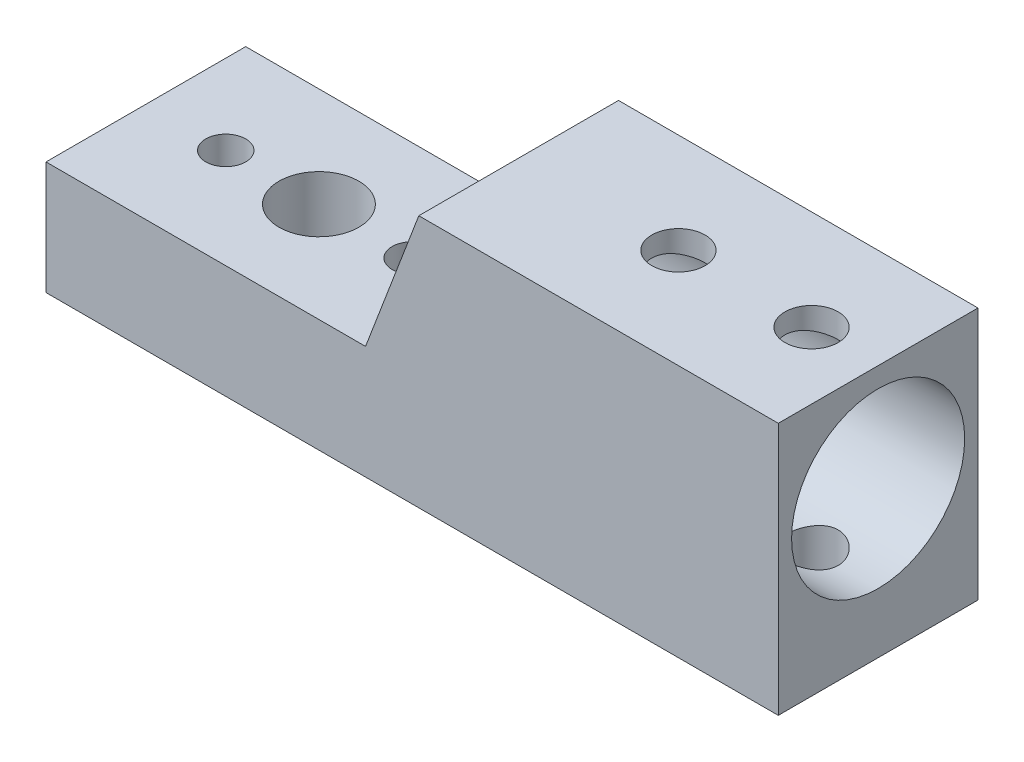
ISO-10303-21;
HEADER;
FILE_DESCRIPTION(('STEP AP214'),'2;1');
FILE_NAME('part.step','',(''),(''),'','','');
FILE_SCHEMA(('AUTOMOTIVE_DESIGN { 1 0 10303 214 1 1 1 1 }'));
ENDSEC;
DATA;
#1=APPLICATION_CONTEXT('core data for automotive mechanical design processes');
#2=APPLICATION_PROTOCOL_DEFINITION('international standard','automotive_design',2000,#1);
#3=PRODUCT_CONTEXT('',#1,'mechanical');
#4=PRODUCT('Part','Part','',(#3));
#5=PRODUCT_RELATED_PRODUCT_CATEGORY('part','',(#4));
#6=PRODUCT_DEFINITION_FORMATION('','',#4);
#7=PRODUCT_DEFINITION_CONTEXT('part definition',#1,'design');
#8=PRODUCT_DEFINITION('design','',#6,#7);
#9=PRODUCT_DEFINITION_SHAPE('','',#8);
#10=(LENGTH_UNIT() NAMED_UNIT(*) SI_UNIT(.MILLI.,.METRE.));
#11=(NAMED_UNIT(*) PLANE_ANGLE_UNIT() SI_UNIT($,.RADIAN.));
#12=(NAMED_UNIT(*) SI_UNIT($,.STERADIAN.) SOLID_ANGLE_UNIT());
#13=UNCERTAINTY_MEASURE_WITH_UNIT(LENGTH_MEASURE(1.E-05),#10,'distance_accuracy_value','');
#14=(GEOMETRIC_REPRESENTATION_CONTEXT(3) GLOBAL_UNCERTAINTY_ASSIGNED_CONTEXT((#13)) GLOBAL_UNIT_ASSIGNED_CONTEXT((#10,
#11,#12)) REPRESENTATION_CONTEXT('',''));
#15=CARTESIAN_POINT('',(0.,0.,0.));
#16=DIRECTION('',(0.,0.,1.));
#17=DIRECTION('',(1.,0.,0.));
#18=AXIS2_PLACEMENT_3D('',#15,#16,#17);
#19=CARTESIAN_POINT('',(-9.99999999999999,-11.,1.44582529709298E-13));
#20=DIRECTION('',(0.,1.,0.));
#21=DIRECTION('',(0.,0.,1.));
#22=AXIS2_PLACEMENT_3D('',#19,#20,#21);
#23=CYLINDRICAL_SURFACE('',#22,1.5);
#24=CARTESIAN_POINT('',(-9.99999999999999,-2.5,1.45716771982052E-13));
#25=DIRECTION('',(0.,1.,0.));
#26=DIRECTION('',(0.,0.,1.));
#27=AXIS2_PLACEMENT_3D('',#24,#25,#26);
#28=CIRCLE('',#27,1.5);
#29=CARTESIAN_POINT('',(-9.99999999999999,-2.5,1.50000000000015));
#30=VERTEX_POINT('',#29);
#31=EDGE_CURVE('E214',#30,#30,#28,.T.);
#32=ORIENTED_EDGE('',*,*,#31,.T.);
#33=EDGE_LOOP('',(#32));
#34=FACE_BOUND('',#33,.T.);
#35=CARTESIAN_POINT('',(-9.99999999999999,-8.,1.44982850511446E-13));
#36=DIRECTION('',(0.,-1.,0.));
#37=DIRECTION('',(0.,0.,-1.));
#38=AXIS2_PLACEMENT_3D('',#35,#36,#37);
#39=CIRCLE('',#38,1.5);
#40=CARTESIAN_POINT('',(-9.99999999999999,-8.,-1.49999999999986));
#41=VERTEX_POINT('',#40);
#42=EDGE_CURVE('E41',#41,#41,#39,.F.);
#43=ORIENTED_EDGE('',*,*,#42,.F.);
#44=EDGE_LOOP('',(#43));
#45=FACE_BOUND('',#44,.T.);
#46=ADVANCED_FACE('F37',(#34,#45),#23,.F.);
#47=CARTESIAN_POINT('',(25.,0.,7.5));
#48=DIRECTION('',(0.,0.,1.));
#49=DIRECTION('',(1.,0.,0.));
#50=AXIS2_PLACEMENT_3D('',#47,#48,#49);
#51=PLANE('',#50);
#52=DIRECTION('',(-1.,0.,0.));
#53=VECTOR('',#52,1.);
#54=CARTESIAN_POINT('',(25.,8.,7.5));
#55=LINE('',#54,#53);
#56=CARTESIAN_POINT('',(25.,8.,7.5));
#57=VERTEX_POINT('',#56);
#58=CARTESIAN_POINT('',(-2.,8.,7.5));
#59=VERTEX_POINT('',#58);
#60=EDGE_CURVE('E189',#57,#59,#55,.T.);
#61=ORIENTED_EDGE('',*,*,#60,.T.);
#62=DIRECTION('',(0.35599532759199,0.934487734928967,0.));
#63=VECTOR('',#62,1.);
#64=CARTESIAN_POINT('',(-6.,-2.5,7.5));
#65=LINE('',#64,#63);
#66=CARTESIAN_POINT('',(-6.00000000000001,-2.5,7.5));
#67=VERTEX_POINT('',#66);
#68=EDGE_CURVE('E11',#59,#67,#65,.F.);
#69=ORIENTED_EDGE('',*,*,#68,.T.);
#70=DIRECTION('',(1.,0.,0.));
#71=VECTOR('',#70,1.);
#72=CARTESIAN_POINT('',(-30.,-2.5,7.5));
#73=LINE('',#72,#71);
#74=CARTESIAN_POINT('',(-30.,-2.5,7.5));
#75=VERTEX_POINT('',#74);
#76=EDGE_CURVE('E124',#75,#67,#73,.T.);
#77=ORIENTED_EDGE('',*,*,#76,.F.);
#78=DIRECTION('',(0.,1.,0.));
#79=VECTOR('',#78,1.);
#80=CARTESIAN_POINT('',(-30.,-11.,7.5));
#81=LINE('',#80,#79);
#82=CARTESIAN_POINT('',(-30.,-11.,7.5));
#83=VERTEX_POINT('',#82);
#84=EDGE_CURVE('E112',#83,#75,#81,.T.);
#85=ORIENTED_EDGE('',*,*,#84,.F.);
#86=DIRECTION('',(-1.,0.,0.));
#87=VECTOR('',#86,1.);
#88=CARTESIAN_POINT('',(25.,-11.,7.5));
#89=LINE('',#88,#87);
#90=CARTESIAN_POINT('',(25.,-11.,7.5));
#91=VERTEX_POINT('',#90);
#92=EDGE_CURVE('E103',#91,#83,#89,.T.);
#93=ORIENTED_EDGE('',*,*,#92,.F.);
#94=DIRECTION('',(0.,1.,0.));
#95=VECTOR('',#94,1.);
#96=CARTESIAN_POINT('',(25.,0.,7.5));
#97=LINE('',#96,#95);
#98=EDGE_CURVE('E192',#91,#57,#97,.T.);
#99=ORIENTED_EDGE('',*,*,#98,.T.);
#100=EDGE_LOOP('',(#61,#69,#77,#85,#93,#99));
#101=FACE_BOUND('',#100,.T.);
#102=ADVANCED_FACE('F180',(#101),#51,.T.);
#103=CARTESIAN_POINT('',(25.,-11.,0.));
#104=DIRECTION('',(0.,1.,0.));
#105=DIRECTION('',(0.,0.,1.));
#106=AXIS2_PLACEMENT_3D('',#103,#104,#105);
#107=PLANE('',#106);
#108=CARTESIAN_POINT('',(-9.99999999999999,-11.,1.41704667942741E-13));
#109=DIRECTION('',(0.,-1.,0.));
#110=DIRECTION('',(0.,0.,-1.));
#111=AXIS2_PLACEMENT_3D('',#108,#109,#110);
#112=CIRCLE('',#111,3.);
#113=CARTESIAN_POINT('',(-9.99999999999999,-11.,-2.99999999999986));
#114=VERTEX_POINT('',#113);
#115=EDGE_CURVE('E216',#114,#114,#112,.T.);
#116=ORIENTED_EDGE('',*,*,#115,.F.);
#117=EDGE_LOOP('',(#116));
#118=FACE_BOUND('',#117,.T.);
#119=CARTESIAN_POINT('',(-24.,-11.,1.41704667942741E-13));
#120=DIRECTION('',(0.,-1.,0.));
#121=DIRECTION('',(0.,0.,1.));
#122=AXIS2_PLACEMENT_3D('',#119,#120,#121);
#123=CIRCLE('',#122,3.);
#124=CARTESIAN_POINT('',(-24.,-11.,3.00000000000014));
#125=VERTEX_POINT('',#124);
#126=EDGE_CURVE('E226',#125,#125,#123,.T.);
#127=ORIENTED_EDGE('',*,*,#126,.F.);
#128=EDGE_LOOP('',(#127));
#129=FACE_BOUND('',#128,.T.);
#130=CARTESIAN_POINT('',(10.,-11.,0.));
#131=DIRECTION('',(0.,1.,0.));
#132=DIRECTION('',(0.,0.,1.));
#133=AXIS2_PLACEMENT_3D('',#130,#131,#132);
#134=CIRCLE('',#133,2.);
#135=CARTESIAN_POINT('',(10.,-11.,2.));
#136=VERTEX_POINT('',#135);
#137=EDGE_CURVE('E133',#136,#136,#134,.T.);
#138=ORIENTED_EDGE('',*,*,#137,.T.);
#139=EDGE_LOOP('',(#138));
#140=FACE_BOUND('',#139,.T.);
#141=CARTESIAN_POINT('',(20.,-11.,0.));
#142=DIRECTION('',(0.,1.,0.));
#143=DIRECTION('',(0.,0.,1.));
#144=AXIS2_PLACEMENT_3D('',#141,#142,#143);
#145=CIRCLE('',#144,2.);
#146=CARTESIAN_POINT('',(20.,-11.,2.));
#147=VERTEX_POINT('',#146);
#148=EDGE_CURVE('E134',#147,#147,#145,.T.);
#149=ORIENTED_EDGE('',*,*,#148,.T.);
#150=EDGE_LOOP('',(#149));
#151=FACE_BOUND('',#150,.T.);
#152=ORIENTED_EDGE('',*,*,#92,.T.);
#153=DIRECTION('',(0.,0.,1.));
#154=VECTOR('',#153,1.);
#155=CARTESIAN_POINT('',(-30.,-11.,7.5));
#156=LINE('',#155,#154);
#157=CARTESIAN_POINT('',(-30.,-11.,-7.5));
#158=VERTEX_POINT('',#157);
#159=EDGE_CURVE('E109',#158,#83,#156,.T.);
#160=ORIENTED_EDGE('',*,*,#159,.F.);
#161=DIRECTION('',(-1.,0.,0.));
#162=VECTOR('',#161,1.);
#163=CARTESIAN_POINT('',(25.,-11.,-7.5));
#164=LINE('',#163,#162);
#165=CARTESIAN_POINT('',(25.,-11.,-7.5));
#166=VERTEX_POINT('',#165);
#167=EDGE_CURVE('E91',#166,#158,#164,.T.);
#168=ORIENTED_EDGE('',*,*,#167,.F.);
#169=DIRECTION('',(0.,0.,-1.));
#170=VECTOR('',#169,1.);
#171=CARTESIAN_POINT('',(25.,-11.,0.));
#172=LINE('',#171,#170);
#173=EDGE_CURVE('E244',#91,#166,#172,.T.);
#174=ORIENTED_EDGE('',*,*,#173,.F.);
#175=EDGE_LOOP('',(#152,#160,#168,#174));
#176=FACE_BOUND('',#175,.T.);
#177=CARTESIAN_POINT('',(-17.,-11.,0.));
#178=DIRECTION('',(0.,1.,0.));
#179=DIRECTION('',(0.,0.,1.));
#180=AXIS2_PLACEMENT_3D('',#177,#178,#179);
#181=CIRCLE('',#180,3.);
#182=CARTESIAN_POINT('',(-17.,-11.,3.));
#183=VERTEX_POINT('',#182);
#184=EDGE_CURVE('E126',#183,#183,#181,.T.);
#185=ORIENTED_EDGE('',*,*,#184,.T.);
#186=EDGE_LOOP('',(#185));
#187=FACE_BOUND('',#186,.T.);
#188=ADVANCED_FACE('F114',(#118,#129,#140,#151,#176,#187),#107,.F.);
#189=CARTESIAN_POINT('',(25.,0.,-7.5));
#190=DIRECTION('',(0.,0.,1.));
#191=DIRECTION('',(1.,0.,0.));
#192=AXIS2_PLACEMENT_3D('',#189,#190,#191);
#193=PLANE('',#192);
#194=ORIENTED_EDGE('',*,*,#167,.T.);
#195=DIRECTION('',(0.,1.,0.));
#196=VECTOR('',#195,1.);
#197=CARTESIAN_POINT('',(-30.,-11.,-7.5));
#198=LINE('',#197,#196);
#199=CARTESIAN_POINT('',(-30.,-2.5,-7.5));
#200=VERTEX_POINT('',#199);
#201=EDGE_CURVE('E95',#158,#200,#198,.T.);
#202=ORIENTED_EDGE('',*,*,#201,.T.);
#203=DIRECTION('',(-1.,0.,0.));
#204=VECTOR('',#203,1.);
#205=CARTESIAN_POINT('',(-30.,-2.5,-7.5));
#206=LINE('',#205,#204);
#207=CARTESIAN_POINT('',(-6.00000000000001,-2.5,-7.5));
#208=VERTEX_POINT('',#207);
#209=EDGE_CURVE('E118',#208,#200,#206,.T.);
#210=ORIENTED_EDGE('',*,*,#209,.F.);
#211=DIRECTION('',(-0.35599532759199,-0.934487734928967,0.));
#212=VECTOR('',#211,1.);
#213=CARTESIAN_POINT('',(-1.23960396039598,9.99603960396045,-7.5));
#214=LINE('',#213,#212);
#215=CARTESIAN_POINT('',(-2.,8.,-7.5));
#216=VERTEX_POINT('',#215);
#217=EDGE_CURVE('E46',#208,#216,#214,.F.);
#218=ORIENTED_EDGE('',*,*,#217,.T.);
#219=DIRECTION('',(-1.,0.,0.));
#220=VECTOR('',#219,1.);
#221=CARTESIAN_POINT('',(25.,8.,-7.5));
#222=LINE('',#221,#220);
#223=CARTESIAN_POINT('',(25.,8.,-7.5));
#224=VERTEX_POINT('',#223);
#225=EDGE_CURVE('E104',#224,#216,#222,.T.);
#226=ORIENTED_EDGE('',*,*,#225,.F.);
#227=DIRECTION('',(0.,1.,0.));
#228=VECTOR('',#227,1.);
#229=CARTESIAN_POINT('',(25.,0.,-7.5));
#230=LINE('',#229,#228);
#231=EDGE_CURVE('E98',#166,#224,#230,.T.);
#232=ORIENTED_EDGE('',*,*,#231,.F.);
#233=EDGE_LOOP('',(#194,#202,#210,#218,#226,#232));
#234=FACE_BOUND('',#233,.T.);
#235=ADVANCED_FACE('F93',(#234),#193,.F.);
#236=CARTESIAN_POINT('',(25.,0.,0.));
#237=DIRECTION('',(-1.,0.,0.));
#238=DIRECTION('',(0.,0.,1.));
#239=AXIS2_PLACEMENT_3D('',#236,#237,#238);
#240=CYLINDRICAL_SURFACE('',#239,6.5);
#241=CARTESIAN_POINT('',(10.,-6.18465843842649,2.));
#242=CARTESIAN_POINT('',(10.1094478166652,-6.18465930196192,1.9999990095568));
#243=CARTESIAN_POINT('',(10.2189054848382,-6.18759551962699,1.99098535833565));
#244=CARTESIAN_POINT('',(10.4346111816852,-6.19897317486936,1.95526805100871));
#245=CARTESIAN_POINT('',(10.5408582544629,-6.20741623543611,1.92855917969017));
#246=CARTESIAN_POINT('',(10.746987807974,-6.22876273970596,1.85845185053104));
#247=CARTESIAN_POINT('',(10.8468809407582,-6.24165847214778,1.8150822317129));
#248=CARTESIAN_POINT('',(11.0379998508988,-6.27044669026987,1.71298018316394));
#249=CARTESIAN_POINT('',(11.1292241832341,-6.28633967425533,1.65424519824938));
#250=CARTESIAN_POINT('',(11.303453569472,-6.31992519486664,1.52098542811857));
#251=CARTESIAN_POINT('',(11.3861274234922,-6.33765756932836,1.44603755808562));
#252=CARTESIAN_POINT('',(11.5379537180837,-6.37258438430366,1.28338536224739));
#253=CARTESIAN_POINT('',(11.607104329982,-6.38977875180184,1.19567931401686));
#254=CARTESIAN_POINT('',(11.7313736379995,-6.4221466710909,1.00762969104172));
#255=CARTESIAN_POINT('',(11.7861525678529,-6.43726783390859,0.907051779246697));
#256=CARTESIAN_POINT('',(11.8778889420094,-6.46332130744831,0.697566498611637));
#257=CARTESIAN_POINT('',(11.9148504403184,-6.47425457092804,0.588661031083086));
#258=CARTESIAN_POINT('',(11.9688007146125,-6.49041842306583,0.369078789668962));
#259=CARTESIAN_POINT('',(11.986355276722,-6.49581021502431,0.258553108996815));
#260=CARTESIAN_POINT('',(12.0027846064267,-6.50085231846729,0.0360024805210005));
#261=CARTESIAN_POINT('',(12.0016634945557,-6.50050389645219,-0.0760221311138332));
#262=CARTESIAN_POINT('',(11.9811484452717,-6.49421773787331,-0.294413564221151));
#263=CARTESIAN_POINT('',(11.9623675952985,-6.48846753941673,-0.400844233271027));
#264=CARTESIAN_POINT('',(11.9080704095831,-6.47225351889556,-0.608962506037097));
#265=CARTESIAN_POINT('',(11.8725529940272,-6.46178939269855,-0.710649803253991));
#266=CARTESIAN_POINT('',(11.7853887565814,-6.43706860960458,-0.907825983957049));
#267=CARTESIAN_POINT('',(11.7335532609179,-6.42276789460409,-1.00322571036047));
#268=CARTESIAN_POINT('',(11.6153748075945,-6.39188462555487,-1.18416561152014));
#269=CARTESIAN_POINT('',(11.5490282680811,-6.37530150850161,-1.26970334400255));
#270=CARTESIAN_POINT('',(11.4005508893297,-6.34083036356049,-1.43214818143839));
#271=CARTESIAN_POINT('',(11.3178900149194,-6.32291668577951,-1.50856604633594));
#272=CARTESIAN_POINT('',(11.1407560606776,-6.28838540910676,-1.64659789158783));
#273=CARTESIAN_POINT('',(11.0462816782687,-6.27176795346722,-1.70821023726841));
#274=CARTESIAN_POINT('',(10.8468569317561,-6.24158384080898,-1.81542815284785));
#275=CARTESIAN_POINT('',(10.7418065852194,-6.22805120968131,-1.86085804249382));
#276=CARTESIAN_POINT('',(10.5250312826704,-6.20596978963966,-1.93323233909798));
#277=CARTESIAN_POINT('',(10.4133086528347,-6.19741927485068,-1.96018314804153));
#278=CARTESIAN_POINT('',(10.1910354718452,-6.18665163283591,-1.99390183839658));
#279=CARTESIAN_POINT('',(10.0806095197673,-6.18420022355391,-2.00141677206859));
#280=CARTESIAN_POINT('',(9.86006861403926,-6.18525890294931,-1.99814331840788));
#281=CARTESIAN_POINT('',(9.74995361655913,-6.18876810464339,-1.98735765434067));
#282=CARTESIAN_POINT('',(9.53633739526088,-6.20112183020873,-1.94845591378718));
#283=CARTESIAN_POINT('',(9.43273743020314,-6.2098155474974,-1.92082922102701));
#284=CARTESIAN_POINT('',(9.23165311791169,-6.23140033431748,-1.84960144317458));
#285=CARTESIAN_POINT('',(9.13416975068449,-6.24429207442193,-1.80599780585853));
#286=CARTESIAN_POINT('',(8.94506908836895,-6.27326823548526,-1.70266083632211));
#287=CARTESIAN_POINT('',(8.85369214786031,-6.28943187401987,-1.642510447689));
#288=CARTESIAN_POINT('',(8.68205645444877,-6.32296420859206,-1.50827755720534));
#289=CARTESIAN_POINT('',(8.60180051059716,-6.34033320743476,-1.43419154645756));
#290=CARTESIAN_POINT('',(8.45137542136322,-6.37515982745186,-1.27066455897644));
#291=CARTESIAN_POINT('',(8.38173805229887,-6.39259321140603,-1.18072798127101));
#292=CARTESIAN_POINT('',(8.25852596385662,-6.4248880498859,-0.990026292988484));
#293=CARTESIAN_POINT('',(8.20495048188052,-6.43974962650362,-0.889261696820765));
#294=CARTESIAN_POINT('',(8.11589889700059,-6.46513895511409,-0.680404349890929));
#295=CARTESIAN_POINT('',(8.08028985839773,-6.47569842330933,-0.572372332564445));
#296=CARTESIAN_POINT('',(8.02785823424431,-6.49143353701507,-0.351472208803097));
#297=CARTESIAN_POINT('',(8.01102996689852,-6.49661081078226,-0.238605575732807));
#298=CARTESIAN_POINT('',(7.99708774938302,-6.50089371028741,-0.0161425784559015));
#299=CARTESIAN_POINT('',(7.99920450881628,-6.50023627237803,0.0934015930792316));
#300=CARTESIAN_POINT('',(8.02124019750521,-6.49348761016137,0.310503921550124));
#301=CARTESIAN_POINT('',(8.04115802587313,-6.48739672187997,0.418062200881386));
#302=CARTESIAN_POINT('',(8.0977458122438,-6.47053765408911,0.626896153328702));
#303=CARTESIAN_POINT('',(8.13421524667688,-6.45982553572913,0.728231001104438));
#304=CARTESIAN_POINT('',(8.22269063398323,-6.43482974334373,0.923394028801654));
#305=CARTESIAN_POINT('',(8.27469921078922,-6.42054546619161,1.01722093754076));
#306=CARTESIAN_POINT('',(8.39477473631908,-6.38931014060288,1.19809140790342));
#307=CARTESIAN_POINT('',(8.463317333803,-6.37228632231703,1.28480651115009));
#308=CARTESIAN_POINT('',(8.61366948951745,-6.33770998123227,1.44576009155785));
#309=CARTESIAN_POINT('',(8.69548295904987,-6.32015730380927,1.51999487724007));
#310=CARTESIAN_POINT('',(8.87317697614795,-6.28584951367575,1.65626040321864));
#311=CARTESIAN_POINT('',(8.96942235514311,-6.26913756348218,1.71782754366812));
#312=CARTESIAN_POINT('',(9.17139075347286,-6.23912274318891,1.82384213502379));
#313=CARTESIAN_POINT('',(9.27710963003581,-6.22581839266759,1.86829702453285));
#314=CARTESIAN_POINT('',(9.48478819820058,-6.20530356949791,1.93528263381637));
#315=CARTESIAN_POINT('',(9.58616631120831,-6.19763764909695,1.95948210366414));
#316=CARTESIAN_POINT('',(9.79169373301637,-6.18731524290854,1.99183943194677));
#317=CARTESIAN_POINT('',(9.89584240542432,-6.18465761663054,2.00000094256957));
#318=CARTESIAN_POINT('',(10.,-6.18465843842649,2.));
#319=B_SPLINE_CURVE_WITH_KNOTS('',3,(#241,#242,#243,#244,#245,#246,#247,#248,#249,#250,#251,
#252,#253,#254,#255,#256,#257,#258,#259,#260,#261,#262,#263,#264,#265,#266,#267,#268,#269,#270,
#271,#272,#273,#274,#275,#276,#277,#278,#279,#280,#281,#282,#283,#284,#285,#286,#287,#288,#289,
#290,#291,#292,#293,#294,#295,#296,#297,#298,#299,#300,#301,#302,#303,#304,#305,#306,#307,#308,
#309,#310,#311,#312,#313,#314,#315,#316,#317,#318),.UNSPECIFIED.,.T.,.F.,(4,2,2,2,2,2,2,2,2,2,2,
2,2,2,2,2,2,2,2,2,2,2,2,2,2,2,2,2,2,2,2,2,2,2,2,2,2,2,4),(0.,0.327958904824528,
0.656014510157334,0.98350480582627,1.31104959615494,1.64848092871026,1.9859578587312,
2.33081172384083,2.67558708716039,3.01002171776409,3.34438256088806,3.66754797200325,
3.99073423603839,4.3178037154465,4.64495401879588,4.98534121479607,5.32576597561372,
5.66978125697086,6.0136772956479,6.34414407424117,6.67456168122459,6.99580726669392,
7.31710419166197,7.64738828171957,7.9777556467148,8.32133560221227,8.66489924238097,
9.00588210329354,9.34676177779273,9.6738643713567,10.0009467370162,10.3241681048257,
10.6474440825282,10.9814486359995,11.3155518095369,11.6602881883484,12.0048745424383,
12.3170524660658,12.6291592918299),.UNSPECIFIED.);
#320=CARTESIAN_POINT('',(10.,-6.18465843842649,2.));
#321=VERTEX_POINT('',#320);
#322=EDGE_CURVE('E201',#321,#321,#319,.T.);
#323=ORIENTED_EDGE('',*,*,#322,.F.);
#324=EDGE_LOOP('',(#323));
#325=FACE_BOUND('',#324,.T.);
#326=CARTESIAN_POINT('',(10.,6.18465843842649,2.));
#327=CARTESIAN_POINT('',(9.89055218333477,6.18465930196192,1.9999990095568));
#328=CARTESIAN_POINT('',(9.78109451516176,6.18759551962699,1.99098535833565));
#329=CARTESIAN_POINT('',(9.5653888183148,6.19897317486936,1.95526805100871));
#330=CARTESIAN_POINT('',(9.45914174553714,6.20741623543611,1.92855917969017));
#331=CARTESIAN_POINT('',(9.25301219202596,6.22876273970596,1.85845185053104));
#332=CARTESIAN_POINT('',(9.15311905924181,6.24165847214778,1.8150822317129));
#333=CARTESIAN_POINT('',(8.96200014910121,6.27044669026987,1.71298018316394));
#334=CARTESIAN_POINT('',(8.87077581676594,6.28633967425533,1.65424519824938));
#335=CARTESIAN_POINT('',(8.69654643052799,6.31992519486664,1.52098542811857));
#336=CARTESIAN_POINT('',(8.61387257650782,6.33765756932836,1.44603755808562));
#337=CARTESIAN_POINT('',(8.46204628191629,6.37258438430366,1.28338536224739));
#338=CARTESIAN_POINT('',(8.392895670018,6.38977875180184,1.19567931401686));
#339=CARTESIAN_POINT('',(8.26862636200054,6.4221466710909,1.00762969104172));
#340=CARTESIAN_POINT('',(8.21384743214713,6.43726783390859,0.907051779246697));
#341=CARTESIAN_POINT('',(8.12211105799065,6.46332130744831,0.697566498611637));
#342=CARTESIAN_POINT('',(8.08514955968164,6.47425457092804,0.588661031083086));
#343=CARTESIAN_POINT('',(8.03119928538751,6.49041842306583,0.369078789668962));
#344=CARTESIAN_POINT('',(8.01364472327802,6.49581021502431,0.258553108996815));
#345=CARTESIAN_POINT('',(7.99721539357325,6.50085231846729,0.0360024805210005));
#346=CARTESIAN_POINT('',(7.99833650544427,6.50050389645219,-0.0760221311138332));
#347=CARTESIAN_POINT('',(8.01885155472825,6.49421773787331,-0.294413564221151));
#348=CARTESIAN_POINT('',(8.03763240470151,6.48846753941673,-0.400844233271027));
#349=CARTESIAN_POINT('',(8.09192959041688,6.47225351889556,-0.608962506037097));
#350=CARTESIAN_POINT('',(8.1274470059728,6.46178939269855,-0.710649803253991));
#351=CARTESIAN_POINT('',(8.21461124341862,6.43706860960458,-0.907825983957049));
#352=CARTESIAN_POINT('',(8.26644673908213,6.42276789460409,-1.00322571036047));
#353=CARTESIAN_POINT('',(8.38462519240552,6.39188462555487,-1.18416561152014));
#354=CARTESIAN_POINT('',(8.45097173191889,6.37530150850161,-1.26970334400255));
#355=CARTESIAN_POINT('',(8.59944911067027,6.34083036356049,-1.43214818143839));
#356=CARTESIAN_POINT('',(8.68210998508059,6.32291668577951,-1.50856604633594));
#357=CARTESIAN_POINT('',(8.85924393932243,6.28838540910676,-1.64659789158783));
#358=CARTESIAN_POINT('',(8.95371832173134,6.27176795346722,-1.70821023726841));
#359=CARTESIAN_POINT('',(9.15314306824387,6.24158384080898,-1.81542815284785));
#360=CARTESIAN_POINT('',(9.25819341478064,6.22805120968131,-1.86085804249382));
#361=CARTESIAN_POINT('',(9.47496871732961,6.20596978963966,-1.93323233909798));
#362=CARTESIAN_POINT('',(9.58669134716533,6.19741927485068,-1.96018314804153));
#363=CARTESIAN_POINT('',(9.80896452815476,6.18665163283591,-1.99390183839658));
#364=CARTESIAN_POINT('',(9.9193904802327,6.18420022355391,-2.00141677206859));
#365=CARTESIAN_POINT('',(10.1399313859607,6.18525890294931,-1.99814331840788));
#366=CARTESIAN_POINT('',(10.2500463834409,6.18876810464339,-1.98735765434067));
#367=CARTESIAN_POINT('',(10.4636626047391,6.20112183020873,-1.94845591378718));
#368=CARTESIAN_POINT('',(10.5672625697969,6.2098155474974,-1.92082922102701));
#369=CARTESIAN_POINT('',(10.7683468820883,6.23140033431748,-1.84960144317458));
#370=CARTESIAN_POINT('',(10.8658302493155,6.24429207442193,-1.80599780585853));
#371=CARTESIAN_POINT('',(11.0549309116311,6.27326823548526,-1.70266083632211));
#372=CARTESIAN_POINT('',(11.1463078521397,6.28943187401987,-1.642510447689));
#373=CARTESIAN_POINT('',(11.3179435455512,6.32296420859206,-1.50827755720534));
#374=CARTESIAN_POINT('',(11.3981994894028,6.34033320743476,-1.43419154645756));
#375=CARTESIAN_POINT('',(11.5486245786368,6.37515982745186,-1.27066455897644));
#376=CARTESIAN_POINT('',(11.6182619477011,6.39259321140603,-1.18072798127101));
#377=CARTESIAN_POINT('',(11.7414740361434,6.4248880498859,-0.990026292988484));
#378=CARTESIAN_POINT('',(11.7950495181195,6.43974962650362,-0.889261696820765));
#379=CARTESIAN_POINT('',(11.8841011029994,6.46513895511409,-0.680404349890929));
#380=CARTESIAN_POINT('',(11.9197101416023,6.47569842330933,-0.572372332564445));
#381=CARTESIAN_POINT('',(11.9721417657557,6.49143353701507,-0.351472208803097));
#382=CARTESIAN_POINT('',(11.9889700331015,6.49661081078226,-0.238605575732807));
#383=CARTESIAN_POINT('',(12.002912250617,6.50089371028741,-0.0161425784559015));
#384=CARTESIAN_POINT('',(12.0007954911837,6.50023627237803,0.0934015930792316));
#385=CARTESIAN_POINT('',(11.9787598024948,6.49348761016137,0.310503921550124));
#386=CARTESIAN_POINT('',(11.9588419741269,6.48739672187997,0.418062200881386));
#387=CARTESIAN_POINT('',(11.9022541877562,6.47053765408911,0.626896153328702));
#388=CARTESIAN_POINT('',(11.8657847533231,6.45982553572913,0.728231001104438));
#389=CARTESIAN_POINT('',(11.7773093660168,6.43482974334373,0.923394028801654));
#390=CARTESIAN_POINT('',(11.7253007892108,6.42054546619161,1.01722093754076));
#391=CARTESIAN_POINT('',(11.6052252636809,6.38931014060288,1.19809140790342));
#392=CARTESIAN_POINT('',(11.536682666197,6.37228632231703,1.28480651115009));
#393=CARTESIAN_POINT('',(11.3863305104826,6.33770998123227,1.44576009155785));
#394=CARTESIAN_POINT('',(11.3045170409501,6.32015730380927,1.51999487724007));
#395=CARTESIAN_POINT('',(11.126823023852,6.28584951367575,1.65626040321864));
#396=CARTESIAN_POINT('',(11.0305776448569,6.26913756348218,1.71782754366812));
#397=CARTESIAN_POINT('',(10.8286092465271,6.23912274318891,1.82384213502379));
#398=CARTESIAN_POINT('',(10.7228903699642,6.22581839266759,1.86829702453285));
#399=CARTESIAN_POINT('',(10.5152118017994,6.20530356949791,1.93528263381637));
#400=CARTESIAN_POINT('',(10.4138336887917,6.19763764909695,1.95948210366414));
#401=CARTESIAN_POINT('',(10.2083062669836,6.18731524290854,1.99183943194677));
#402=CARTESIAN_POINT('',(10.1041575945757,6.18465761663054,2.00000094256957));
#403=CARTESIAN_POINT('',(10.,6.18465843842649,2.));
#404=B_SPLINE_CURVE_WITH_KNOTS('',3,(#326,#327,#328,#329,#330,#331,#332,#333,#334,#335,#336,
#337,#338,#339,#340,#341,#342,#343,#344,#345,#346,#347,#348,#349,#350,#351,#352,#353,#354,#355,
#356,#357,#358,#359,#360,#361,#362,#363,#364,#365,#366,#367,#368,#369,#370,#371,#372,#373,#374,
#375,#376,#377,#378,#379,#380,#381,#382,#383,#384,#385,#386,#387,#388,#389,#390,#391,#392,#393,
#394,#395,#396,#397,#398,#399,#400,#401,#402,#403),.UNSPECIFIED.,.T.,.F.,(4,2,2,2,2,2,2,2,2,2,2,
2,2,2,2,2,2,2,2,2,2,2,2,2,2,2,2,2,2,2,2,2,2,2,2,2,2,2,4),(0.,0.327958904824528,
0.656014510157334,0.983504805826269,1.31104959615494,1.64848092871026,1.9859578587312,
2.33081172384083,2.67558708716039,3.01002171776409,3.34438256088806,3.66754797200325,
3.99073423603839,4.3178037154465,4.64495401879588,4.98534121479607,5.32576597561372,
5.66978125697086,6.0136772956479,6.34414407424117,6.67456168122459,6.99580726669392,
7.31710419166197,7.64738828171957,7.9777556467148,8.32133560221227,8.66489924238097,
9.00588210329355,9.34676177779273,9.6738643713567,10.0009467370162,10.3241681048257,
10.6474440825282,10.9814486359995,11.3155518095369,11.6602881883484,12.0048745424383,
12.3170524660658,12.6291592918299),.UNSPECIFIED.);
#405=CARTESIAN_POINT('',(10.,6.18465843842649,2.));
#406=VERTEX_POINT('',#405);
#407=EDGE_CURVE('E268',#406,#406,#404,.T.);
#408=ORIENTED_EDGE('',*,*,#407,.F.);
#409=EDGE_LOOP('',(#408));
#410=FACE_BOUND('',#409,.T.);
#411=CARTESIAN_POINT('',(20.,-6.18465843842649,2.));
#412=CARTESIAN_POINT('',(20.1094478166652,-6.18465930196192,1.9999990095568));
#413=CARTESIAN_POINT('',(20.2189054848382,-6.18759551962699,1.99098535833566));
#414=CARTESIAN_POINT('',(20.4346111816852,-6.19897317486936,1.95526805100872));
#415=CARTESIAN_POINT('',(20.5408582544629,-6.2074162354361,1.92855917969018));
#416=CARTESIAN_POINT('',(20.746987807974,-6.22876273970596,1.85845185053105));
#417=CARTESIAN_POINT('',(20.8468809407582,-6.24165847214777,1.81508223171291));
#418=CARTESIAN_POINT('',(21.0379998508988,-6.27044669026987,1.71298018316394));
#419=CARTESIAN_POINT('',(21.1292241832341,-6.28633967425533,1.65424519824938));
#420=CARTESIAN_POINT('',(21.303453569472,-6.31992519486664,1.52098542811858));
#421=CARTESIAN_POINT('',(21.3861274234922,-6.33765756932836,1.44603755808562));
#422=CARTESIAN_POINT('',(21.5379537180837,-6.37258438430366,1.28338536224739));
#423=CARTESIAN_POINT('',(21.607104329982,-6.38977875180184,1.19567931401686));
#424=CARTESIAN_POINT('',(21.7313736379995,-6.4221466710909,1.00762969104172));
#425=CARTESIAN_POINT('',(21.7861525678529,-6.43726783390859,0.907051779246697));
#426=CARTESIAN_POINT('',(21.8778889420094,-6.46332130744831,0.697566498611638));
#427=CARTESIAN_POINT('',(21.9148504403184,-6.47425457092804,0.588661031083087));
#428=CARTESIAN_POINT('',(21.9688007146125,-6.49041842306583,0.369078789668963));
#429=CARTESIAN_POINT('',(21.986355276722,-6.49581021502431,0.258553108996815));
#430=CARTESIAN_POINT('',(22.0027846064268,-6.50085231846729,0.0360024805209994));
#431=CARTESIAN_POINT('',(22.0016634945557,-6.50050389645219,-0.0760221311138346));
#432=CARTESIAN_POINT('',(21.9811484452718,-6.49421773787331,-0.294413564221153));
#433=CARTESIAN_POINT('',(21.9623675952985,-6.48846753941673,-0.40084423327103));
#434=CARTESIAN_POINT('',(21.9080704095831,-6.47225351889556,-0.6089625060371));
#435=CARTESIAN_POINT('',(21.8725529940272,-6.46178939269855,-0.710649803253994));
#436=CARTESIAN_POINT('',(21.7853887565814,-6.43706860960458,-0.907825983957053));
#437=CARTESIAN_POINT('',(21.7335532609179,-6.42276789460409,-1.00322571036048));
#438=CARTESIAN_POINT('',(21.6153748075945,-6.39188462555487,-1.18416561152014));
#439=CARTESIAN_POINT('',(21.5490282680811,-6.37530150850161,-1.26970334400256));
#440=CARTESIAN_POINT('',(21.4005508893297,-6.34083036356049,-1.43214818143839));
#441=CARTESIAN_POINT('',(21.3178900149194,-6.32291668577951,-1.50856604633594));
#442=CARTESIAN_POINT('',(21.1407560606776,-6.28838540910675,-1.64659789158783));
#443=CARTESIAN_POINT('',(21.0462816782687,-6.27176795346722,-1.70821023726841));
#444=CARTESIAN_POINT('',(20.8468569317561,-6.24158384080898,-1.81542815284785));
#445=CARTESIAN_POINT('',(20.7418065852194,-6.22805120968131,-1.86085804249383));
#446=CARTESIAN_POINT('',(20.5250312826704,-6.20596978963966,-1.93323233909799));
#447=CARTESIAN_POINT('',(20.4133086528347,-6.19741927485068,-1.96018314804153));
#448=CARTESIAN_POINT('',(20.1910354718452,-6.18665163283591,-1.99390183839659));
#449=CARTESIAN_POINT('',(20.0806095197673,-6.18420022355391,-2.00141677206859));
#450=CARTESIAN_POINT('',(19.8600686140393,-6.18525890294931,-1.99814331840789));
#451=CARTESIAN_POINT('',(19.7499536165591,-6.18876810464339,-1.98735765434068));
#452=CARTESIAN_POINT('',(19.5363373952609,-6.20112183020873,-1.94845591378718));
#453=CARTESIAN_POINT('',(19.4327374302031,-6.2098155474974,-1.92082922102701));
#454=CARTESIAN_POINT('',(19.2316531179117,-6.23140033431748,-1.84960144317458));
#455=CARTESIAN_POINT('',(19.1341697506845,-6.24429207442193,-1.80599780585854));
#456=CARTESIAN_POINT('',(18.9450690883689,-6.27326823548526,-1.70266083632212));
#457=CARTESIAN_POINT('',(18.8536921478603,-6.28943187401987,-1.64251044768901));
#458=CARTESIAN_POINT('',(18.6820564544488,-6.32296420859206,-1.50827755720534));
#459=CARTESIAN_POINT('',(18.6018005105972,-6.34033320743476,-1.43419154645756));
#460=CARTESIAN_POINT('',(18.4513754213632,-6.37515982745186,-1.27066455897645));
#461=CARTESIAN_POINT('',(18.3817380522989,-6.39259321140603,-1.18072798127102));
#462=CARTESIAN_POINT('',(18.2585259638566,-6.4248880498859,-0.990026292988486));
#463=CARTESIAN_POINT('',(18.2049504818805,-6.43974962650362,-0.889261696820768));
#464=CARTESIAN_POINT('',(18.1158988970006,-6.46513895511408,-0.680404349890931));
#465=CARTESIAN_POINT('',(18.0802898583977,-6.47569842330933,-0.572372332564448));
#466=CARTESIAN_POINT('',(18.0278582342443,-6.49143353701507,-0.351472208803099));
#467=CARTESIAN_POINT('',(18.0110299668985,-6.49661081078226,-0.238605575732807));
#468=CARTESIAN_POINT('',(17.997087749383,-6.50089371028741,-0.0161425784559013));
#469=CARTESIAN_POINT('',(17.9992045088163,-6.50023627237803,0.0934015930792316));
#470=CARTESIAN_POINT('',(18.0212401975052,-6.49348761016137,0.310503921550124));
#471=CARTESIAN_POINT('',(18.0411580258731,-6.48739672187997,0.418062200881387));
#472=CARTESIAN_POINT('',(18.0977458122438,-6.47053765408911,0.626896153328705));
#473=CARTESIAN_POINT('',(18.1342152466769,-6.45982553572913,0.728231001104441));
#474=CARTESIAN_POINT('',(18.2226906339832,-6.43482974334373,0.923394028801658));
#475=CARTESIAN_POINT('',(18.2746992107892,-6.4205454661916,1.01722093754076));
#476=CARTESIAN_POINT('',(18.3947747363191,-6.38931014060288,1.19809140790342));
#477=CARTESIAN_POINT('',(18.463317333803,-6.37228632231703,1.28480651115009));
#478=CARTESIAN_POINT('',(18.6136694895174,-6.33770998123227,1.44576009155786));
#479=CARTESIAN_POINT('',(18.6954829590499,-6.32015730380927,1.51999487724008));
#480=CARTESIAN_POINT('',(18.8731769761479,-6.28584951367575,1.65626040321865));
#481=CARTESIAN_POINT('',(18.9694223551431,-6.26913756348217,1.71782754366813));
#482=CARTESIAN_POINT('',(19.1713907534729,-6.23912274318891,1.8238421350238));
#483=CARTESIAN_POINT('',(19.2771096300358,-6.22581839266759,1.86829702453285));
#484=CARTESIAN_POINT('',(19.4847881982006,-6.20530356949791,1.93528263381638));
#485=CARTESIAN_POINT('',(19.5861663112083,-6.19763764909695,1.95948210366415));
#486=CARTESIAN_POINT('',(19.7916937330164,-6.18731524290854,1.99183943194677));
#487=CARTESIAN_POINT('',(19.8958424054243,-6.18465761663054,2.00000094256957));
#488=CARTESIAN_POINT('',(20.,-6.18465843842649,2.));
#489=B_SPLINE_CURVE_WITH_KNOTS('',3,(#411,#412,#413,#414,#415,#416,#417,#418,#419,#420,#421,
#422,#423,#424,#425,#426,#427,#428,#429,#430,#431,#432,#433,#434,#435,#436,#437,#438,#439,#440,
#441,#442,#443,#444,#445,#446,#447,#448,#449,#450,#451,#452,#453,#454,#455,#456,#457,#458,#459,
#460,#461,#462,#463,#464,#465,#466,#467,#468,#469,#470,#471,#472,#473,#474,#475,#476,#477,#478,
#479,#480,#481,#482,#483,#484,#485,#486,#487,#488),.UNSPECIFIED.,.T.,.F.,(4,2,2,2,2,2,2,2,2,2,2,
2,2,2,2,2,2,2,2,2,2,2,2,2,2,2,2,2,2,2,2,2,2,2,2,2,2,2,4),(0.,0.327958904824532,
0.656014510157337,0.983504805826269,1.31104959615495,1.64848092871027,1.98595785873121,
2.33081172384084,2.6755870871604,3.0100217177641,3.34438256088807,3.66754797200327,
3.99073423603841,4.31780371544652,4.6449540187959,4.98534121479609,5.32576597561374,
5.66978125697088,6.01367729564792,6.3441440742412,6.67456168122461,6.99580726669395,
7.317104191662,7.64738828171959,7.97775564671483,8.3213356022123,8.664899242381,
9.00588210329357,9.34676177779276,9.67386437135673,10.0009467370162,10.3241681048257,
10.6474440825282,10.9814486359996,11.3155518095369,11.6602881883485,12.0048745424384,
12.3170524660658,12.6291592918299),.UNSPECIFIED.);
#490=CARTESIAN_POINT('',(20.,-6.18465843842649,2.));
#491=VERTEX_POINT('',#490);
#492=EDGE_CURVE('E147',#491,#491,#489,.T.);
#493=ORIENTED_EDGE('',*,*,#492,.F.);
#494=EDGE_LOOP('',(#493));
#495=FACE_BOUND('',#494,.T.);
#496=CARTESIAN_POINT('',(20.,6.18465843842649,2.));
#497=CARTESIAN_POINT('',(19.8905521833348,6.18465930196192,1.9999990095568));
#498=CARTESIAN_POINT('',(19.7810945151618,6.18759551962699,1.99098535833566));
#499=CARTESIAN_POINT('',(19.5653888183148,6.19897317486936,1.95526805100872));
#500=CARTESIAN_POINT('',(19.4591417455371,6.2074162354361,1.92855917969018));
#501=CARTESIAN_POINT('',(19.253012192026,6.22876273970596,1.85845185053105));
#502=CARTESIAN_POINT('',(19.1531190592418,6.24165847214777,1.81508223171291));
#503=CARTESIAN_POINT('',(18.9620001491012,6.27044669026987,1.71298018316394));
#504=CARTESIAN_POINT('',(18.8707758167659,6.28633967425533,1.65424519824938));
#505=CARTESIAN_POINT('',(18.696546430528,6.31992519486664,1.52098542811858));
#506=CARTESIAN_POINT('',(18.6138725765078,6.33765756932836,1.44603755808562));
#507=CARTESIAN_POINT('',(18.4620462819163,6.37258438430366,1.28338536224739));
#508=CARTESIAN_POINT('',(18.392895670018,6.38977875180184,1.19567931401686));
#509=CARTESIAN_POINT('',(18.2686263620005,6.4221466710909,1.00762969104172));
#510=CARTESIAN_POINT('',(18.2138474321471,6.43726783390859,0.907051779246696));
#511=CARTESIAN_POINT('',(18.1221110579906,6.46332130744831,0.697566498611637));
#512=CARTESIAN_POINT('',(18.0851495596816,6.47425457092804,0.588661031083087));
#513=CARTESIAN_POINT('',(18.0311992853875,6.49041842306583,0.369078789668963));
#514=CARTESIAN_POINT('',(18.013644723278,6.49581021502431,0.258553108996815));
#515=CARTESIAN_POINT('',(17.9972153935732,6.50085231846729,0.0360024805209994));
#516=CARTESIAN_POINT('',(17.9983365054443,6.50050389645219,-0.0760221311138346));
#517=CARTESIAN_POINT('',(18.0188515547282,6.49421773787331,-0.294413564221153));
#518=CARTESIAN_POINT('',(18.0376324047015,6.48846753941673,-0.40084423327103));
#519=CARTESIAN_POINT('',(18.0919295904169,6.47225351889556,-0.6089625060371));
#520=CARTESIAN_POINT('',(18.1274470059728,6.46178939269855,-0.710649803253994));
#521=CARTESIAN_POINT('',(18.2146112434186,6.43706860960458,-0.907825983957053));
#522=CARTESIAN_POINT('',(18.2664467390821,6.42276789460409,-1.00322571036048));
#523=CARTESIAN_POINT('',(18.3846251924055,6.39188462555487,-1.18416561152014));
#524=CARTESIAN_POINT('',(18.4509717319189,6.37530150850161,-1.26970334400256));
#525=CARTESIAN_POINT('',(18.5994491106703,6.34083036356049,-1.43214818143839));
#526=CARTESIAN_POINT('',(18.6821099850806,6.32291668577951,-1.50856604633594));
#527=CARTESIAN_POINT('',(18.8592439393224,6.28838540910675,-1.64659789158783));
#528=CARTESIAN_POINT('',(18.9537183217313,6.27176795346722,-1.70821023726841));
#529=CARTESIAN_POINT('',(19.1531430682439,6.24158384080898,-1.81542815284785));
#530=CARTESIAN_POINT('',(19.2581934147806,6.22805120968131,-1.86085804249383));
#531=CARTESIAN_POINT('',(19.4749687173296,6.20596978963966,-1.93323233909799));
#532=CARTESIAN_POINT('',(19.5866913471653,6.19741927485068,-1.96018314804153));
#533=CARTESIAN_POINT('',(19.8089645281548,6.18665163283591,-1.99390183839659));
#534=CARTESIAN_POINT('',(19.9193904802327,6.18420022355391,-2.00141677206859));
#535=CARTESIAN_POINT('',(20.1399313859607,6.18525890294931,-1.99814331840789));
#536=CARTESIAN_POINT('',(20.2500463834409,6.18876810464339,-1.98735765434068));
#537=CARTESIAN_POINT('',(20.4636626047391,6.20112183020873,-1.94845591378718));
#538=CARTESIAN_POINT('',(20.5672625697969,6.2098155474974,-1.92082922102701));
#539=CARTESIAN_POINT('',(20.7683468820883,6.23140033431748,-1.84960144317458));
#540=CARTESIAN_POINT('',(20.8658302493155,6.24429207442193,-1.80599780585854));
#541=CARTESIAN_POINT('',(21.0549309116311,6.27326823548526,-1.70266083632212));
#542=CARTESIAN_POINT('',(21.1463078521397,6.28943187401987,-1.64251044768901));
#543=CARTESIAN_POINT('',(21.3179435455512,6.32296420859206,-1.50827755720534));
#544=CARTESIAN_POINT('',(21.3981994894028,6.34033320743476,-1.43419154645756));
#545=CARTESIAN_POINT('',(21.5486245786368,6.37515982745186,-1.27066455897645));
#546=CARTESIAN_POINT('',(21.6182619477011,6.39259321140603,-1.18072798127102));
#547=CARTESIAN_POINT('',(21.7414740361434,6.4248880498859,-0.990026292988486));
#548=CARTESIAN_POINT('',(21.7950495181195,6.43974962650362,-0.889261696820768));
#549=CARTESIAN_POINT('',(21.8841011029994,6.46513895511408,-0.680404349890931));
#550=CARTESIAN_POINT('',(21.9197101416023,6.47569842330933,-0.572372332564448));
#551=CARTESIAN_POINT('',(21.9721417657557,6.49143353701507,-0.351472208803099));
#552=CARTESIAN_POINT('',(21.9889700331015,6.49661081078226,-0.238605575732807));
#553=CARTESIAN_POINT('',(22.002912250617,6.50089371028741,-0.0161425784559013));
#554=CARTESIAN_POINT('',(22.0007954911837,6.50023627237803,0.0934015930792318));
#555=CARTESIAN_POINT('',(21.9787598024948,6.49348761016137,0.310503921550125));
#556=CARTESIAN_POINT('',(21.9588419741269,6.48739672187997,0.418062200881387));
#557=CARTESIAN_POINT('',(21.9022541877562,6.47053765408911,0.626896153328705));
#558=CARTESIAN_POINT('',(21.8657847533231,6.45982553572913,0.728231001104441));
#559=CARTESIAN_POINT('',(21.7773093660168,6.43482974334373,0.923394028801658));
#560=CARTESIAN_POINT('',(21.7253007892108,6.4205454661916,1.01722093754076));
#561=CARTESIAN_POINT('',(21.6052252636809,6.38931014060288,1.19809140790342));
#562=CARTESIAN_POINT('',(21.536682666197,6.37228632231703,1.28480651115009));
#563=CARTESIAN_POINT('',(21.3863305104826,6.33770998123227,1.44576009155785));
#564=CARTESIAN_POINT('',(21.3045170409501,6.32015730380927,1.51999487724007));
#565=CARTESIAN_POINT('',(21.1268230238521,6.28584951367575,1.65626040321865));
#566=CARTESIAN_POINT('',(21.0305776448569,6.26913756348217,1.71782754366813));
#567=CARTESIAN_POINT('',(20.8286092465271,6.23912274318891,1.8238421350238));
#568=CARTESIAN_POINT('',(20.7228903699642,6.22581839266759,1.86829702453285));
#569=CARTESIAN_POINT('',(20.5152118017994,6.20530356949791,1.93528263381638));
#570=CARTESIAN_POINT('',(20.4138336887917,6.19763764909695,1.95948210366415));
#571=CARTESIAN_POINT('',(20.2083062669836,6.18731524290854,1.99183943194677));
#572=CARTESIAN_POINT('',(20.1041575945757,6.18465761663054,2.00000094256957));
#573=CARTESIAN_POINT('',(20.,6.18465843842649,2.));
#574=B_SPLINE_CURVE_WITH_KNOTS('',3,(#496,#497,#498,#499,#500,#501,#502,#503,#504,#505,#506,
#507,#508,#509,#510,#511,#512,#513,#514,#515,#516,#517,#518,#519,#520,#521,#522,#523,#524,#525,
#526,#527,#528,#529,#530,#531,#532,#533,#534,#535,#536,#537,#538,#539,#540,#541,#542,#543,#544,
#545,#546,#547,#548,#549,#550,#551,#552,#553,#554,#555,#556,#557,#558,#559,#560,#561,#562,#563,
#564,#565,#566,#567,#568,#569,#570,#571,#572,#573),.UNSPECIFIED.,.T.,.F.,(4,2,2,2,2,2,2,2,2,2,2,
2,2,2,2,2,2,2,2,2,2,2,2,2,2,2,2,2,2,2,2,2,2,2,2,2,2,2,4),(0.,0.327958904824532,
0.656014510157337,0.983504805826269,1.31104959615495,1.64848092871027,1.98595785873121,
2.33081172384084,2.6755870871604,3.0100217177641,3.34438256088807,3.66754797200327,
3.99073423603841,4.31780371544652,4.6449540187959,4.98534121479609,5.32576597561374,
5.66978125697088,6.01367729564792,6.3441440742412,6.67456168122461,6.99580726669395,
7.317104191662,7.64738828171959,7.97775564671483,8.3213356022123,8.664899242381,
9.00588210329357,9.34676177779276,9.67386437135673,10.0009467370162,10.3241681048257,
10.6474440825282,10.9814486359996,11.3155518095369,11.6602881883485,12.0048745424384,
12.3170524660658,12.6291592918299),.UNSPECIFIED.);
#575=CARTESIAN_POINT('',(20.,6.18465843842649,2.));
#576=VERTEX_POINT('',#575);
#577=EDGE_CURVE('E137',#576,#576,#574,.T.);
#578=ORIENTED_EDGE('',*,*,#577,.F.);
#579=EDGE_LOOP('',(#578));
#580=FACE_BOUND('',#579,.T.);
#581=CARTESIAN_POINT('',(25.,0.,0.));
#582=DIRECTION('',(1.,0.,0.));
#583=DIRECTION('',(0.,0.,-1.));
#584=AXIS2_PLACEMENT_3D('',#581,#582,#583);
#585=CIRCLE('',#584,6.5);
#586=CARTESIAN_POINT('',(25.,0.,-6.5));
#587=VERTEX_POINT('',#586);
#588=EDGE_CURVE('E247',#587,#587,#585,.T.);
#589=ORIENTED_EDGE('',*,*,#588,.T.);
#590=EDGE_LOOP('',(#589));
#591=FACE_BOUND('',#590,.T.);
#592=CARTESIAN_POINT('',(0.,0.,0.));
#593=DIRECTION('',(1.,0.,0.));
#594=DIRECTION('',(0.,0.,-1.));
#595=AXIS2_PLACEMENT_3D('',#592,#593,#594);
#596=CIRCLE('',#595,6.5);
#597=CARTESIAN_POINT('',(0.,0.,-6.5));
#598=VERTEX_POINT('',#597);
#599=EDGE_CURVE('E200',#598,#598,#596,.T.);
#600=ORIENTED_EDGE('',*,*,#599,.F.);
#601=EDGE_LOOP('',(#600));
#602=FACE_BOUND('',#601,.T.);
#603=ADVANCED_FACE('F151',(#325,#410,#495,#580,#591,#602),#240,.F.);
#604=CARTESIAN_POINT('',(25.,8.,0.));
#605=DIRECTION('',(0.,1.,0.));
#606=DIRECTION('',(0.,0.,1.));
#607=AXIS2_PLACEMENT_3D('',#604,#605,#606);
#608=PLANE('',#607);
#609=CARTESIAN_POINT('',(10.,8.,0.));
#610=DIRECTION('',(0.,1.,0.));
#611=DIRECTION('',(0.,0.,1.));
#612=AXIS2_PLACEMENT_3D('',#609,#610,#611);
#613=CIRCLE('',#612,2.);
#614=CARTESIAN_POINT('',(10.,8.,2.));
#615=VERTEX_POINT('',#614);
#616=EDGE_CURVE('E130',#615,#615,#613,.T.);
#617=ORIENTED_EDGE('',*,*,#616,.F.);
#618=EDGE_LOOP('',(#617));
#619=FACE_BOUND('',#618,.T.);
#620=CARTESIAN_POINT('',(20.,8.,0.));
#621=DIRECTION('',(0.,1.,0.));
#622=DIRECTION('',(0.,0.,1.));
#623=AXIS2_PLACEMENT_3D('',#620,#621,#622);
#624=CIRCLE('',#623,2.);
#625=CARTESIAN_POINT('',(20.,8.,2.));
#626=VERTEX_POINT('',#625);
#627=EDGE_CURVE('E128',#626,#626,#624,.T.);
#628=ORIENTED_EDGE('',*,*,#627,.F.);
#629=EDGE_LOOP('',(#628));
#630=FACE_BOUND('',#629,.T.);
#631=ORIENTED_EDGE('',*,*,#225,.T.);
#632=DIRECTION('',(0.,0.,1.));
#633=VECTOR('',#632,1.);
#634=CARTESIAN_POINT('',(-2.,8.,-7.5));
#635=LINE('',#634,#633);
#636=EDGE_CURVE('E199',#216,#59,#635,.T.);
#637=ORIENTED_EDGE('',*,*,#636,.T.);
#638=ORIENTED_EDGE('',*,*,#60,.F.);
#639=DIRECTION('',(0.,0.,-1.));
#640=VECTOR('',#639,1.);
#641=CARTESIAN_POINT('',(25.,8.,0.));
#642=LINE('',#641,#640);
#643=EDGE_CURVE('E196',#57,#224,#642,.T.);
#644=ORIENTED_EDGE('',*,*,#643,.T.);
#645=EDGE_LOOP('',(#631,#637,#638,#644));
#646=FACE_BOUND('',#645,.T.);
#647=ADVANCED_FACE('F172',(#619,#630,#646),#608,.T.);
#648=CARTESIAN_POINT('',(25.,0.,0.));
#649=DIRECTION('',(1.,0.,0.));
#650=DIRECTION('',(0.,0.,-1.));
#651=AXIS2_PLACEMENT_3D('',#648,#649,#650);
#652=PLANE('',#651);
#653=ORIENTED_EDGE('',*,*,#588,.F.);
#654=EDGE_LOOP('',(#653));
#655=FACE_BOUND('',#654,.T.);
#656=ORIENTED_EDGE('',*,*,#98,.F.);
#657=ORIENTED_EDGE('',*,*,#173,.T.);
#658=ORIENTED_EDGE('',*,*,#231,.T.);
#659=ORIENTED_EDGE('',*,*,#643,.F.);
#660=EDGE_LOOP('',(#656,#657,#658,#659));
#661=FACE_BOUND('',#660,.T.);
#662=ADVANCED_FACE('F168',(#655,#661),#652,.T.);
#663=CARTESIAN_POINT('',(0.,0.,0.));
#664=DIRECTION('',(-1.,0.,0.));
#665=DIRECTION('',(0.,0.,1.));
#666=AXIS2_PLACEMENT_3D('',#663,#664,#665);
#667=PLANE('',#666);
#668=ORIENTED_EDGE('',*,*,#599,.T.);
#669=EDGE_LOOP('',(#668));
#670=FACE_BOUND('',#669,.T.);
#671=ADVANCED_FACE('F160',(#670),#667,.F.);
#672=CARTESIAN_POINT('',(20.,-11.,0.));
#673=DIRECTION('',(0.,1.,0.));
#674=DIRECTION('',(0.,0.,1.));
#675=AXIS2_PLACEMENT_3D('',#672,#673,#674);
#676=CYLINDRICAL_SURFACE('',#675,2.);
#677=ORIENTED_EDGE('',*,*,#577,.T.);
#678=EDGE_LOOP('',(#677));
#679=FACE_BOUND('',#678,.T.);
#680=ORIENTED_EDGE('',*,*,#627,.T.);
#681=EDGE_LOOP('',(#680));
#682=FACE_BOUND('',#681,.T.);
#683=ADVANCED_FACE('F154',(#679,#682),#676,.F.);
#684=CARTESIAN_POINT('',(10.,-11.,0.));
#685=DIRECTION('',(0.,1.,0.));
#686=DIRECTION('',(0.,0.,1.));
#687=AXIS2_PLACEMENT_3D('',#684,#685,#686);
#688=CYLINDRICAL_SURFACE('',#687,2.);
#689=ORIENTED_EDGE('',*,*,#407,.T.);
#690=EDGE_LOOP('',(#689));
#691=FACE_BOUND('',#690,.T.);
#692=ORIENTED_EDGE('',*,*,#616,.T.);
#693=EDGE_LOOP('',(#692));
#694=FACE_BOUND('',#693,.T.);
#695=ADVANCED_FACE('F159',(#691,#694),#688,.F.);
#696=ORIENTED_EDGE('',*,*,#492,.T.);
#697=EDGE_LOOP('',(#696));
#698=FACE_BOUND('',#697,.T.);
#699=ORIENTED_EDGE('',*,*,#148,.F.);
#700=EDGE_LOOP('',(#699));
#701=FACE_BOUND('',#700,.T.);
#702=ADVANCED_FACE('F162',(#698,#701),#676,.F.);
#703=ORIENTED_EDGE('',*,*,#322,.T.);
#704=EDGE_LOOP('',(#703));
#705=FACE_BOUND('',#704,.T.);
#706=ORIENTED_EDGE('',*,*,#137,.F.);
#707=EDGE_LOOP('',(#706));
#708=FACE_BOUND('',#707,.T.);
#709=ADVANCED_FACE('F286',(#705,#708),#688,.F.);
#710=CARTESIAN_POINT('',(-30.,-11.,7.5));
#711=DIRECTION('',(-1.,0.,0.));
#712=DIRECTION('',(0.,0.,1.));
#713=AXIS2_PLACEMENT_3D('',#710,#711,#712);
#714=PLANE('',#713);
#715=DIRECTION('',(0.,0.,1.));
#716=VECTOR('',#715,1.);
#717=CARTESIAN_POINT('',(-30.,-2.5,7.5));
#718=LINE('',#717,#716);
#719=EDGE_CURVE('E111',#200,#75,#718,.T.);
#720=ORIENTED_EDGE('',*,*,#719,.F.);
#721=ORIENTED_EDGE('',*,*,#201,.F.);
#722=ORIENTED_EDGE('',*,*,#159,.T.);
#723=ORIENTED_EDGE('',*,*,#84,.T.);
#724=EDGE_LOOP('',(#720,#721,#722,#723));
#725=FACE_BOUND('',#724,.T.);
#726=ADVANCED_FACE('F108',(#725),#714,.T.);
#727=CARTESIAN_POINT('',(0.,-2.5,0.));
#728=DIRECTION('',(0.,1.,0.));
#729=DIRECTION('',(0.,0.,1.));
#730=AXIS2_PLACEMENT_3D('',#727,#728,#729);
#731=PLANE('',#730);
#732=CARTESIAN_POINT('',(-24.,-2.5,0.));
#733=DIRECTION('',(0.,1.,0.));
#734=DIRECTION('',(0.,0.,1.));
#735=AXIS2_PLACEMENT_3D('',#732,#733,#734);
#736=CIRCLE('',#735,1.5);
#737=CARTESIAN_POINT('',(-24.,-2.5,1.5));
#738=VERTEX_POINT('',#737);
#739=EDGE_CURVE('E229',#738,#738,#736,.T.);
#740=ORIENTED_EDGE('',*,*,#739,.F.);
#741=EDGE_LOOP('',(#740));
#742=FACE_BOUND('',#741,.T.);
#743=ORIENTED_EDGE('',*,*,#31,.F.);
#744=EDGE_LOOP('',(#743));
#745=FACE_BOUND('',#744,.T.);
#746=CARTESIAN_POINT('',(-17.,-2.5,0.));
#747=DIRECTION('',(0.,1.,0.));
#748=DIRECTION('',(0.,0.,1.));
#749=AXIS2_PLACEMENT_3D('',#746,#747,#748);
#750=CIRCLE('',#749,3.);
#751=CARTESIAN_POINT('',(-17.,-2.5,3.));
#752=VERTEX_POINT('',#751);
#753=EDGE_CURVE('E122',#752,#752,#750,.T.);
#754=ORIENTED_EDGE('',*,*,#753,.F.);
#755=EDGE_LOOP('',(#754));
#756=FACE_BOUND('',#755,.T.);
#757=ORIENTED_EDGE('',*,*,#76,.T.);
#758=DIRECTION('',(0.,0.,-1.));
#759=VECTOR('',#758,1.);
#760=CARTESIAN_POINT('',(-6.,-2.5,-7.5));
#761=LINE('',#760,#759);
#762=EDGE_CURVE('E203',#67,#208,#761,.T.);
#763=ORIENTED_EDGE('',*,*,#762,.T.);
#764=ORIENTED_EDGE('',*,*,#209,.T.);
#765=ORIENTED_EDGE('',*,*,#719,.T.);
#766=EDGE_LOOP('',(#757,#763,#764,#765));
#767=FACE_BOUND('',#766,.T.);
#768=ADVANCED_FACE('F240',(#742,#745,#756,#767),#731,.T.);
#769=CARTESIAN_POINT('',(-17.,-11.,0.));
#770=DIRECTION('',(0.,1.,0.));
#771=DIRECTION('',(0.,0.,1.));
#772=AXIS2_PLACEMENT_3D('',#769,#770,#771);
#773=CYLINDRICAL_SURFACE('',#772,3.);
#774=ORIENTED_EDGE('',*,*,#184,.F.);
#775=EDGE_LOOP('',(#774));
#776=FACE_BOUND('',#775,.T.);
#777=ORIENTED_EDGE('',*,*,#753,.T.);
#778=EDGE_LOOP('',(#777));
#779=FACE_BOUND('',#778,.T.);
#780=ADVANCED_FACE('F238',(#776,#779),#773,.F.);
#781=CARTESIAN_POINT('',(-6.,-2.5,0.));
#782=DIRECTION('',(-0.934487734928967,0.35599532759199,0.));
#783=DIRECTION('',(0.,0.,1.));
#784=AXIS2_PLACEMENT_3D('',#781,#782,#783);
#785=PLANE('',#784);
#786=ORIENTED_EDGE('',*,*,#68,.F.);
#787=ORIENTED_EDGE('',*,*,#636,.F.);
#788=ORIENTED_EDGE('',*,*,#217,.F.);
#789=ORIENTED_EDGE('',*,*,#762,.F.);
#790=EDGE_LOOP('',(#786,#787,#788,#789));
#791=FACE_BOUND('',#790,.T.);
#792=ADVANCED_FACE('F39',(#791),#785,.T.);
#793=CARTESIAN_POINT('',(-24.,-11.,0.));
#794=DIRECTION('',(0.,1.,0.));
#795=DIRECTION('',(0.,0.,1.));
#796=AXIS2_PLACEMENT_3D('',#793,#794,#795);
#797=CYLINDRICAL_SURFACE('',#796,1.5);
#798=CARTESIAN_POINT('',(-24.,-8.,0.));
#799=DIRECTION('',(0.,1.,0.));
#800=DIRECTION('',(0.,0.,1.));
#801=AXIS2_PLACEMENT_3D('',#798,#799,#800);
#802=CIRCLE('',#801,1.5);
#803=CARTESIAN_POINT('',(-24.,-8.,1.5));
#804=VERTEX_POINT('',#803);
#805=EDGE_CURVE('E208',#804,#804,#802,.F.);
#806=ORIENTED_EDGE('',*,*,#805,.T.);
#807=EDGE_LOOP('',(#806));
#808=FACE_BOUND('',#807,.T.);
#809=ORIENTED_EDGE('',*,*,#739,.T.);
#810=EDGE_LOOP('',(#809));
#811=FACE_BOUND('',#810,.T.);
#812=ADVANCED_FACE('F332',(#808,#811),#797,.F.);
#813=CARTESIAN_POINT('',(-24.,-8.,1.42398557333132E-13));
#814=DIRECTION('',(0.,1.,0.));
#815=DIRECTION('',(0.,0.,1.));
#816=AXIS2_PLACEMENT_3D('',#813,#814,#815);
#817=PLANE('',#816);
#818=CARTESIAN_POINT('',(-24.,-8.,1.42398557333132E-13));
#819=DIRECTION('',(0.,-1.,0.));
#820=DIRECTION('',(0.,0.,1.));
#821=AXIS2_PLACEMENT_3D('',#818,#819,#820);
#822=CIRCLE('',#821,3.);
#823=CARTESIAN_POINT('',(-24.,-8.,3.00000000000014));
#824=VERTEX_POINT('',#823);
#825=EDGE_CURVE('E221',#824,#824,#822,.T.);
#826=ORIENTED_EDGE('',*,*,#825,.T.);
#827=EDGE_LOOP('',(#826));
#828=FACE_BOUND('',#827,.T.);
#829=ORIENTED_EDGE('',*,*,#805,.F.);
#830=EDGE_LOOP('',(#829));
#831=FACE_BOUND('',#830,.T.);
#832=ADVANCED_FACE('F365',(#828,#831),#817,.F.);
#833=CARTESIAN_POINT('',(-24.,-8.,1.42398557333132E-13));
#834=DIRECTION('',(0.,-1.,0.));
#835=DIRECTION('',(0.,0.,-1.));
#836=AXIS2_PLACEMENT_3D('',#833,#834,#835);
#837=CYLINDRICAL_SURFACE('',#836,3.);
#838=ORIENTED_EDGE('',*,*,#825,.F.);
#839=EDGE_LOOP('',(#838));
#840=FACE_BOUND('',#839,.T.);
#841=ORIENTED_EDGE('',*,*,#126,.T.);
#842=EDGE_LOOP('',(#841));
#843=FACE_BOUND('',#842,.T.);
#844=ADVANCED_FACE('F373',(#840,#843),#837,.F.);
#845=CARTESIAN_POINT('',(-9.99999999999999,-8.,1.42398557333132E-13));
#846=DIRECTION('',(0.,-1.,0.));
#847=DIRECTION('',(0.,0.,-1.));
#848=AXIS2_PLACEMENT_3D('',#845,#846,#847);
#849=PLANE('',#848);
#850=CARTESIAN_POINT('',(-9.99999999999999,-8.,1.42398557333132E-13));
#851=DIRECTION('',(0.,-1.,0.));
#852=DIRECTION('',(0.,0.,-1.));
#853=AXIS2_PLACEMENT_3D('',#850,#851,#852);
#854=CIRCLE('',#853,3.);
#855=CARTESIAN_POINT('',(-9.99999999999999,-8.,-2.99999999999986));
#856=VERTEX_POINT('',#855);
#857=EDGE_CURVE('E210',#856,#856,#854,.T.);
#858=ORIENTED_EDGE('',*,*,#857,.T.);
#859=EDGE_LOOP('',(#858));
#860=FACE_BOUND('',#859,.T.);
#861=ORIENTED_EDGE('',*,*,#42,.T.);
#862=EDGE_LOOP('',(#861));
#863=FACE_BOUND('',#862,.T.);
#864=ADVANCED_FACE('F383',(#860,#863),#849,.T.);
#865=CARTESIAN_POINT('',(-9.99999999999999,-8.,1.42398557333132E-13));
#866=DIRECTION('',(0.,-1.,0.));
#867=DIRECTION('',(0.,0.,-1.));
#868=AXIS2_PLACEMENT_3D('',#865,#866,#867);
#869=CYLINDRICAL_SURFACE('',#868,3.);
#870=ORIENTED_EDGE('',*,*,#857,.F.);
#871=EDGE_LOOP('',(#870));
#872=FACE_BOUND('',#871,.T.);
#873=ORIENTED_EDGE('',*,*,#115,.T.);
#874=EDGE_LOOP('',(#873));
#875=FACE_BOUND('',#874,.T.);
#876=ADVANCED_FACE('F393',(#872,#875),#869,.F.);
#877=CLOSED_SHELL('',(#46,#102,#188,#235,#603,#647,#662,#671,#683,#695,#702,#709,#726,#768,#780,
#792,#812,#832,#844,#864,#876));
#878=MANIFOLD_SOLID_BREP('B2',#877);
#879=ADVANCED_BREP_SHAPE_REPRESENTATION('',(#18,#878),#14);
#880=SHAPE_DEFINITION_REPRESENTATION(#9,#879);
ENDSEC;
END-ISO-10303-21;
